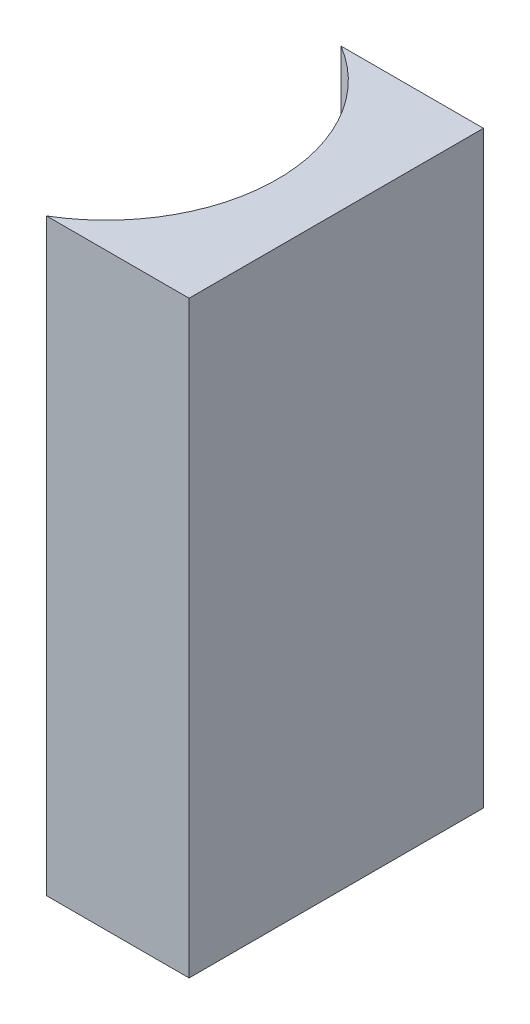
ISO-10303-21;
HEADER;
FILE_DESCRIPTION(('STEP AP214'),'2;1');
FILE_NAME('part.step','',(''),(''),'','','');
FILE_SCHEMA(('AUTOMOTIVE_DESIGN { 1 0 10303 214 1 1 1 1 }'));
ENDSEC;
DATA;
#1=APPLICATION_CONTEXT('core data for automotive mechanical design processes');
#2=APPLICATION_PROTOCOL_DEFINITION('international standard','automotive_design',2000,#1);
#3=PRODUCT_CONTEXT('',#1,'mechanical');
#4=PRODUCT('Part','Part','',(#3));
#5=PRODUCT_RELATED_PRODUCT_CATEGORY('part','',(#4));
#6=PRODUCT_DEFINITION_FORMATION('','',#4);
#7=PRODUCT_DEFINITION_CONTEXT('part definition',#1,'design');
#8=PRODUCT_DEFINITION('design','',#6,#7);
#9=PRODUCT_DEFINITION_SHAPE('','',#8);
#10=(LENGTH_UNIT() NAMED_UNIT(*) SI_UNIT(.MILLI.,.METRE.));
#11=(NAMED_UNIT(*) PLANE_ANGLE_UNIT() SI_UNIT($,.RADIAN.));
#12=(NAMED_UNIT(*) SI_UNIT($,.STERADIAN.) SOLID_ANGLE_UNIT());
#13=UNCERTAINTY_MEASURE_WITH_UNIT(LENGTH_MEASURE(1.E-05),#10,'distance_accuracy_value','');
#14=(GEOMETRIC_REPRESENTATION_CONTEXT(3) GLOBAL_UNCERTAINTY_ASSIGNED_CONTEXT((#13)) GLOBAL_UNIT_ASSIGNED_CONTEXT((#10,
#11,#12)) REPRESENTATION_CONTEXT('',''));
#15=CARTESIAN_POINT('',(0.,0.,0.));
#16=DIRECTION('',(0.,0.,1.));
#17=DIRECTION('',(1.,0.,0.));
#18=AXIS2_PLACEMENT_3D('',#15,#16,#17);
#19=CARTESIAN_POINT('',(0.,20.,0.));
#20=DIRECTION('',(0.,0.,1.));
#21=DIRECTION('',(1.,0.,0.));
#22=AXIS2_PLACEMENT_3D('',#19,#20,#21);
#23=PLANE('',#22);
#24=DIRECTION('',(-1.,0.,0.));
#25=VECTOR('',#24,1.);
#26=CARTESIAN_POINT('',(0.,0.,0.));
#27=LINE('',#26,#25);
#28=CARTESIAN_POINT('',(0.,0.,0.));
#29=VERTEX_POINT('',#28);
#30=CARTESIAN_POINT('',(-4.84134258431757,0.,0.));
#31=VERTEX_POINT('',#30);
#32=EDGE_CURVE('E98',#29,#31,#27,.T.);
#33=ORIENTED_EDGE('',*,*,#32,.T.);
#34=DIRECTION('',(0.,-1.,0.));
#35=VECTOR('',#34,1.);
#36=CARTESIAN_POINT('',(-4.84134258431757,20.,0.));
#37=LINE('',#36,#35);
#38=CARTESIAN_POINT('',(-4.84134258431757,20.,0.));
#39=VERTEX_POINT('',#38);
#40=EDGE_CURVE('E11',#39,#31,#37,.T.);
#41=ORIENTED_EDGE('',*,*,#40,.F.);
#42=DIRECTION('',(-1.,0.,0.));
#43=VECTOR('',#42,1.);
#44=CARTESIAN_POINT('',(0.,20.,0.));
#45=LINE('',#44,#43);
#46=CARTESIAN_POINT('',(0.,20.,0.));
#47=VERTEX_POINT('',#46);
#48=EDGE_CURVE('E86',#47,#39,#45,.T.);
#49=ORIENTED_EDGE('',*,*,#48,.F.);
#50=DIRECTION('',(0.,-1.,0.));
#51=VECTOR('',#50,1.);
#52=CARTESIAN_POINT('',(0.,20.,0.));
#53=LINE('',#52,#51);
#54=EDGE_CURVE('E94',#47,#29,#53,.T.);
#55=ORIENTED_EDGE('',*,*,#54,.T.);
#56=EDGE_LOOP('',(#33,#41,#49,#55));
#57=FACE_BOUND('',#56,.T.);
#58=ADVANCED_FACE('F35',(#57),#23,.F.);
#59=CARTESIAN_POINT('',(-7.81999999999999,20.,5.));
#60=DIRECTION('',(0.,-1.,0.));
#61=DIRECTION('',(0.,0.,-1.));
#62=AXIS2_PLACEMENT_3D('',#59,#60,#61);
#63=CYLINDRICAL_SURFACE('',#62,5.81999999999999);
#64=CARTESIAN_POINT('',(-7.81999999999999,0.,5.));
#65=DIRECTION('',(0.,-1.,0.));
#66=DIRECTION('',(0.,0.,1.));
#67=AXIS2_PLACEMENT_3D('',#64,#65,#66);
#68=CIRCLE('',#67,5.81999999999999);
#69=CARTESIAN_POINT('',(-4.84134258431757,0.,10.));
#70=VERTEX_POINT('',#69);
#71=EDGE_CURVE('E90',#31,#70,#68,.T.);
#72=ORIENTED_EDGE('',*,*,#71,.T.);
#73=DIRECTION('',(0.,-1.,0.));
#74=VECTOR('',#73,1.);
#75=CARTESIAN_POINT('',(-4.84134258431757,20.,10.));
#76=LINE('',#75,#74);
#77=CARTESIAN_POINT('',(-4.84134258431757,20.,10.));
#78=VERTEX_POINT('',#77);
#79=EDGE_CURVE('E43',#78,#70,#76,.T.);
#80=ORIENTED_EDGE('',*,*,#79,.F.);
#81=CARTESIAN_POINT('',(-7.81999999999999,20.,5.));
#82=DIRECTION('',(0.,-1.,0.));
#83=DIRECTION('',(0.,0.,1.));
#84=AXIS2_PLACEMENT_3D('',#81,#82,#83);
#85=CIRCLE('',#84,5.81999999999999);
#86=EDGE_CURVE('E81',#39,#78,#85,.T.);
#87=ORIENTED_EDGE('',*,*,#86,.F.);
#88=ORIENTED_EDGE('',*,*,#40,.T.);
#89=EDGE_LOOP('',(#72,#80,#87,#88));
#90=FACE_BOUND('',#89,.T.);
#91=ADVANCED_FACE('F89',(#90),#63,.F.);
#92=CARTESIAN_POINT('',(0.,20.,10.));
#93=DIRECTION('',(0.,0.,-1.));
#94=DIRECTION('',(-1.,0.,0.));
#95=AXIS2_PLACEMENT_3D('',#92,#93,#94);
#96=PLANE('',#95);
#97=DIRECTION('',(1.,0.,0.));
#98=VECTOR('',#97,1.);
#99=CARTESIAN_POINT('',(0.,0.,10.));
#100=LINE('',#99,#98);
#101=CARTESIAN_POINT('',(0.,0.,10.));
#102=VERTEX_POINT('',#101);
#103=EDGE_CURVE('E68',#70,#102,#100,.T.);
#104=ORIENTED_EDGE('',*,*,#103,.T.);
#105=DIRECTION('',(0.,-1.,0.));
#106=VECTOR('',#105,1.);
#107=CARTESIAN_POINT('',(0.,20.,10.));
#108=LINE('',#107,#106);
#109=CARTESIAN_POINT('',(0.,20.,10.));
#110=VERTEX_POINT('',#109);
#111=EDGE_CURVE('E91',#110,#102,#108,.T.);
#112=ORIENTED_EDGE('',*,*,#111,.F.);
#113=DIRECTION('',(1.,0.,0.));
#114=VECTOR('',#113,1.);
#115=CARTESIAN_POINT('',(0.,20.,10.));
#116=LINE('',#115,#114);
#117=EDGE_CURVE('E84',#78,#110,#116,.T.);
#118=ORIENTED_EDGE('',*,*,#117,.F.);
#119=ORIENTED_EDGE('',*,*,#79,.T.);
#120=EDGE_LOOP('',(#104,#112,#118,#119));
#121=FACE_BOUND('',#120,.T.);
#122=ADVANCED_FACE('F92',(#121),#96,.F.);
#123=CARTESIAN_POINT('',(0.,20.,0.));
#124=DIRECTION('',(-1.,0.,0.));
#125=DIRECTION('',(0.,0.,1.));
#126=AXIS2_PLACEMENT_3D('',#123,#124,#125);
#127=PLANE('',#126);
#128=DIRECTION('',(0.,0.,-1.));
#129=VECTOR('',#128,1.);
#130=CARTESIAN_POINT('',(0.,0.,0.));
#131=LINE('',#130,#129);
#132=EDGE_CURVE('E74',#102,#29,#131,.T.);
#133=ORIENTED_EDGE('',*,*,#132,.T.);
#134=ORIENTED_EDGE('',*,*,#54,.F.);
#135=DIRECTION('',(0.,0.,-1.));
#136=VECTOR('',#135,1.);
#137=CARTESIAN_POINT('',(0.,20.,0.));
#138=LINE('',#137,#136);
#139=EDGE_CURVE('E51',#110,#47,#138,.T.);
#140=ORIENTED_EDGE('',*,*,#139,.F.);
#141=ORIENTED_EDGE('',*,*,#111,.T.);
#142=EDGE_LOOP('',(#133,#134,#140,#141));
#143=FACE_BOUND('',#142,.T.);
#144=ADVANCED_FACE('F105',(#143),#127,.F.);
#145=CARTESIAN_POINT('',(-7.81999999999999,20.,5.));
#146=DIRECTION('',(0.,1.,0.));
#147=DIRECTION('',(0.,0.,1.));
#148=AXIS2_PLACEMENT_3D('',#145,#146,#147);
#149=PLANE('',#148);
#150=ORIENTED_EDGE('',*,*,#48,.T.);
#151=ORIENTED_EDGE('',*,*,#86,.T.);
#152=ORIENTED_EDGE('',*,*,#117,.T.);
#153=ORIENTED_EDGE('',*,*,#139,.T.);
#154=EDGE_LOOP('',(#150,#151,#152,#153));
#155=FACE_BOUND('',#154,.T.);
#156=ADVANCED_FACE('F82',(#155),#149,.T.);
#157=CARTESIAN_POINT('',(-7.81999999999999,0.,5.));
#158=DIRECTION('',(0.,1.,0.));
#159=DIRECTION('',(0.,0.,1.));
#160=AXIS2_PLACEMENT_3D('',#157,#158,#159);
#161=PLANE('',#160);
#162=ORIENTED_EDGE('',*,*,#32,.F.);
#163=ORIENTED_EDGE('',*,*,#132,.F.);
#164=ORIENTED_EDGE('',*,*,#103,.F.);
#165=ORIENTED_EDGE('',*,*,#71,.F.);
#166=EDGE_LOOP('',(#162,#163,#164,#165));
#167=FACE_BOUND('',#166,.T.);
#168=ADVANCED_FACE('F108',(#167),#161,.F.);
#169=CLOSED_SHELL('',(#58,#91,#122,#144,#156,#168));
#170=MANIFOLD_SOLID_BREP('B2',#169);
#171=ADVANCED_BREP_SHAPE_REPRESENTATION('',(#18,#170),#14);
#172=SHAPE_DEFINITION_REPRESENTATION(#9,#171);
ENDSEC;
END-ISO-10303-21;
